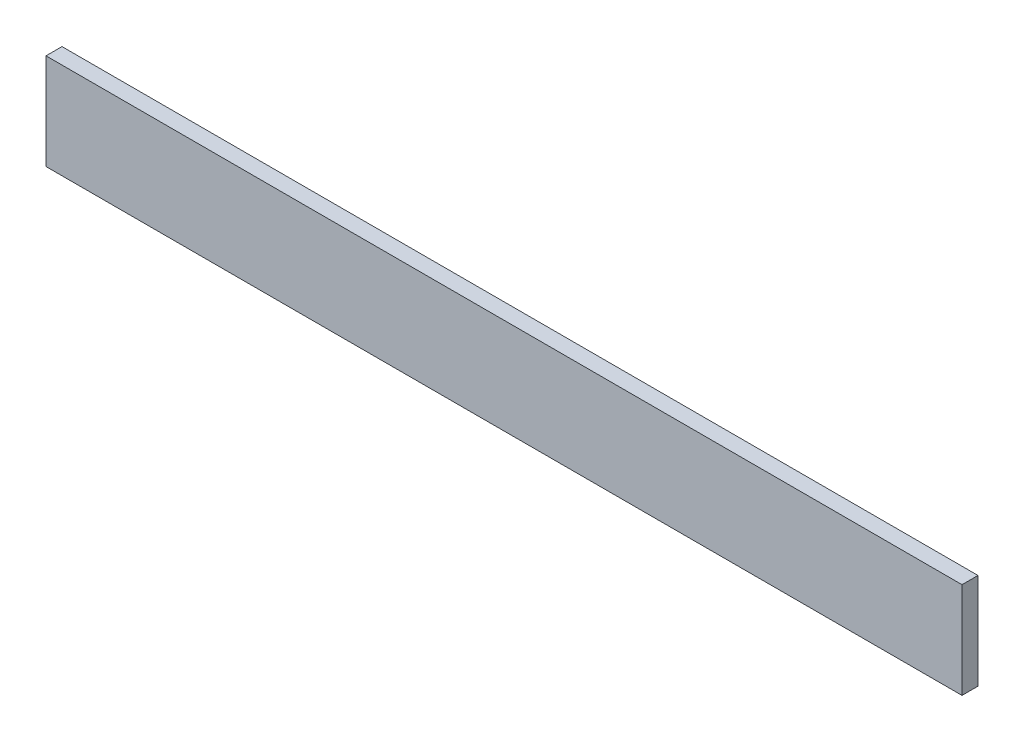
ISO-10303-21;
HEADER;
FILE_DESCRIPTION(('STEP AP214'),'2;1');
FILE_NAME('part.step','',(''),(''),'','','');
FILE_SCHEMA(('AUTOMOTIVE_DESIGN { 1 0 10303 214 1 1 1 1 }'));
ENDSEC;
DATA;
#1=APPLICATION_CONTEXT('core data for automotive mechanical design processes');
#2=APPLICATION_PROTOCOL_DEFINITION('international standard','automotive_design',2000,#1);
#3=PRODUCT_CONTEXT('',#1,'mechanical');
#4=PRODUCT('Part','Part','',(#3));
#5=PRODUCT_RELATED_PRODUCT_CATEGORY('part','',(#4));
#6=PRODUCT_DEFINITION_FORMATION('','',#4);
#7=PRODUCT_DEFINITION_CONTEXT('part definition',#1,'design');
#8=PRODUCT_DEFINITION('design','',#6,#7);
#9=PRODUCT_DEFINITION_SHAPE('','',#8);
#10=(LENGTH_UNIT() NAMED_UNIT(*) SI_UNIT(.MILLI.,.METRE.));
#11=(NAMED_UNIT(*) PLANE_ANGLE_UNIT() SI_UNIT($,.RADIAN.));
#12=(NAMED_UNIT(*) SI_UNIT($,.STERADIAN.) SOLID_ANGLE_UNIT());
#13=UNCERTAINTY_MEASURE_WITH_UNIT(LENGTH_MEASURE(1.E-05),#10,'distance_accuracy_value','');
#14=(GEOMETRIC_REPRESENTATION_CONTEXT(3) GLOBAL_UNCERTAINTY_ASSIGNED_CONTEXT((#13)) GLOBAL_UNIT_ASSIGNED_CONTEXT((#10,
#11,#12)) REPRESENTATION_CONTEXT('',''));
#15=CARTESIAN_POINT('',(0.,0.,0.));
#16=DIRECTION('',(0.,0.,1.));
#17=DIRECTION('',(1.,0.,0.));
#18=AXIS2_PLACEMENT_3D('',#15,#16,#17);
#19=CARTESIAN_POINT('',(143.25,0.,5.));
#20=DIRECTION('',(1.,0.,0.));
#21=DIRECTION('',(0.,0.,-1.));
#22=AXIS2_PLACEMENT_3D('',#19,#20,#21);
#23=PLANE('',#22);
#24=DIRECTION('',(0.,-1.,0.));
#25=VECTOR('',#24,1.);
#26=CARTESIAN_POINT('',(143.25,0.,0.));
#27=LINE('',#26,#25);
#28=CARTESIAN_POINT('',(143.25,15.,0.));
#29=VERTEX_POINT('',#28);
#30=CARTESIAN_POINT('',(143.25,-15.,0.));
#31=VERTEX_POINT('',#30);
#32=EDGE_CURVE('E104',#29,#31,#27,.T.);
#33=ORIENTED_EDGE('',*,*,#32,.F.);
#34=DIRECTION('',(0.,0.,-1.));
#35=VECTOR('',#34,1.);
#36=CARTESIAN_POINT('',(143.25,15.,5.));
#37=LINE('',#36,#35);
#38=CARTESIAN_POINT('',(143.25,15.,5.));
#39=VERTEX_POINT('',#38);
#40=EDGE_CURVE('E11',#39,#29,#37,.T.);
#41=ORIENTED_EDGE('',*,*,#40,.F.);
#42=DIRECTION('',(0.,-1.,0.));
#43=VECTOR('',#42,1.);
#44=CARTESIAN_POINT('',(143.25,0.,5.));
#45=LINE('',#44,#43);
#46=CARTESIAN_POINT('',(143.25,-15.,5.));
#47=VERTEX_POINT('',#46);
#48=EDGE_CURVE('E98',#39,#47,#45,.T.);
#49=ORIENTED_EDGE('',*,*,#48,.T.);
#50=DIRECTION('',(0.,0.,-1.));
#51=VECTOR('',#50,1.);
#52=CARTESIAN_POINT('',(143.25,-15.,5.));
#53=LINE('',#52,#51);
#54=EDGE_CURVE('E79',#47,#31,#53,.T.);
#55=ORIENTED_EDGE('',*,*,#54,.T.);
#56=EDGE_LOOP('',(#33,#41,#49,#55));
#57=FACE_BOUND('',#56,.T.);
#58=ADVANCED_FACE('F41',(#57),#23,.T.);
#59=CARTESIAN_POINT('',(0.,15.,5.));
#60=DIRECTION('',(0.,1.,0.));
#61=DIRECTION('',(0.,0.,1.));
#62=AXIS2_PLACEMENT_3D('',#59,#60,#61);
#63=PLANE('',#62);
#64=DIRECTION('',(1.,0.,0.));
#65=VECTOR('',#64,1.);
#66=CARTESIAN_POINT('',(0.,15.,0.));
#67=LINE('',#66,#65);
#68=CARTESIAN_POINT('',(-143.25,15.000000000002,0.));
#69=VERTEX_POINT('',#68);
#70=EDGE_CURVE('E92',#69,#29,#67,.T.);
#71=ORIENTED_EDGE('',*,*,#70,.F.);
#72=DIRECTION('',(0.,0.,-1.));
#73=VECTOR('',#72,1.);
#74=CARTESIAN_POINT('',(-143.25,15.000000000002,5.));
#75=LINE('',#74,#73);
#76=CARTESIAN_POINT('',(-143.25,15.000000000002,5.));
#77=VERTEX_POINT('',#76);
#78=EDGE_CURVE('E49',#77,#69,#75,.T.);
#79=ORIENTED_EDGE('',*,*,#78,.F.);
#80=DIRECTION('',(1.,0.,0.));
#81=VECTOR('',#80,1.);
#82=CARTESIAN_POINT('',(0.,15.,5.));
#83=LINE('',#82,#81);
#84=EDGE_CURVE('E90',#77,#39,#83,.T.);
#85=ORIENTED_EDGE('',*,*,#84,.T.);
#86=ORIENTED_EDGE('',*,*,#40,.T.);
#87=EDGE_LOOP('',(#71,#79,#85,#86));
#88=FACE_BOUND('',#87,.T.);
#89=ADVANCED_FACE('F88',(#88),#63,.T.);
#90=CARTESIAN_POINT('',(-143.25,1.83186799063151E-12,5.));
#91=DIRECTION('',(1.,0.,0.));
#92=DIRECTION('',(0.,1.,0.));
#93=AXIS2_PLACEMENT_3D('',#90,#91,#92);
#94=PLANE('',#93);
#95=DIRECTION('',(0.,-1.,0.));
#96=VECTOR('',#95,1.);
#97=CARTESIAN_POINT('',(-143.25,1.83186799063151E-12,0.));
#98=LINE('',#97,#96);
#99=CARTESIAN_POINT('',(-143.25,-14.999999999998,0.));
#100=VERTEX_POINT('',#99);
#101=EDGE_CURVE('E72',#69,#100,#98,.T.);
#102=ORIENTED_EDGE('',*,*,#101,.T.);
#103=DIRECTION('',(0.,0.,-1.));
#104=VECTOR('',#103,1.);
#105=CARTESIAN_POINT('',(-143.25,-14.999999999998,5.));
#106=LINE('',#105,#104);
#107=CARTESIAN_POINT('',(-143.25,-14.999999999998,5.));
#108=VERTEX_POINT('',#107);
#109=EDGE_CURVE('E93',#108,#100,#106,.T.);
#110=ORIENTED_EDGE('',*,*,#109,.F.);
#111=DIRECTION('',(0.,-1.,0.));
#112=VECTOR('',#111,1.);
#113=CARTESIAN_POINT('',(-143.25,1.83186799063151E-12,5.));
#114=LINE('',#113,#112);
#115=EDGE_CURVE('E94',#77,#108,#114,.T.);
#116=ORIENTED_EDGE('',*,*,#115,.F.);
#117=ORIENTED_EDGE('',*,*,#78,.T.);
#118=EDGE_LOOP('',(#102,#110,#116,#117));
#119=FACE_BOUND('',#118,.T.);
#120=ADVANCED_FACE('F95',(#119),#94,.F.);
#121=CARTESIAN_POINT('',(0.,-15.,5.));
#122=DIRECTION('',(0.,1.,0.));
#123=DIRECTION('',(0.,0.,1.));
#124=AXIS2_PLACEMENT_3D('',#121,#122,#123);
#125=PLANE('',#124);
#126=DIRECTION('',(1.,0.,0.));
#127=VECTOR('',#126,1.);
#128=CARTESIAN_POINT('',(0.,-15.,0.));
#129=LINE('',#128,#127);
#130=EDGE_CURVE('E100',#100,#31,#129,.T.);
#131=ORIENTED_EDGE('',*,*,#130,.T.);
#132=ORIENTED_EDGE('',*,*,#54,.F.);
#133=DIRECTION('',(1.,0.,0.));
#134=VECTOR('',#133,1.);
#135=CARTESIAN_POINT('',(0.,-15.,5.));
#136=LINE('',#135,#134);
#137=EDGE_CURVE('E57',#108,#47,#136,.T.);
#138=ORIENTED_EDGE('',*,*,#137,.F.);
#139=ORIENTED_EDGE('',*,*,#109,.T.);
#140=EDGE_LOOP('',(#131,#132,#138,#139));
#141=FACE_BOUND('',#140,.T.);
#142=ADVANCED_FACE('F113',(#141),#125,.F.);
#143=CARTESIAN_POINT('',(0.,0.,5.));
#144=DIRECTION('',(0.,0.,1.));
#145=DIRECTION('',(1.,0.,0.));
#146=AXIS2_PLACEMENT_3D('',#143,#144,#145);
#147=PLANE('',#146);
#148=ORIENTED_EDGE('',*,*,#48,.F.);
#149=ORIENTED_EDGE('',*,*,#84,.F.);
#150=ORIENTED_EDGE('',*,*,#115,.T.);
#151=ORIENTED_EDGE('',*,*,#137,.T.);
#152=EDGE_LOOP('',(#148,#149,#150,#151));
#153=FACE_BOUND('',#152,.T.);
#154=ADVANCED_FACE('F97',(#153),#147,.T.);
#155=CARTESIAN_POINT('',(0.,0.,0.));
#156=DIRECTION('',(0.,0.,1.));
#157=DIRECTION('',(1.,0.,0.));
#158=AXIS2_PLACEMENT_3D('',#155,#156,#157);
#159=PLANE('',#158);
#160=ORIENTED_EDGE('',*,*,#32,.T.);
#161=ORIENTED_EDGE('',*,*,#130,.F.);
#162=ORIENTED_EDGE('',*,*,#101,.F.);
#163=ORIENTED_EDGE('',*,*,#70,.T.);
#164=EDGE_LOOP('',(#160,#161,#162,#163));
#165=FACE_BOUND('',#164,.T.);
#166=ADVANCED_FACE('F115',(#165),#159,.F.);
#167=CLOSED_SHELL('',(#58,#89,#120,#142,#154,#166));
#168=MANIFOLD_SOLID_BREP('B2',#167);
#169=ADVANCED_BREP_SHAPE_REPRESENTATION('',(#18,#168),#14);
#170=SHAPE_DEFINITION_REPRESENTATION(#9,#169);
ENDSEC;
END-ISO-10303-21;
